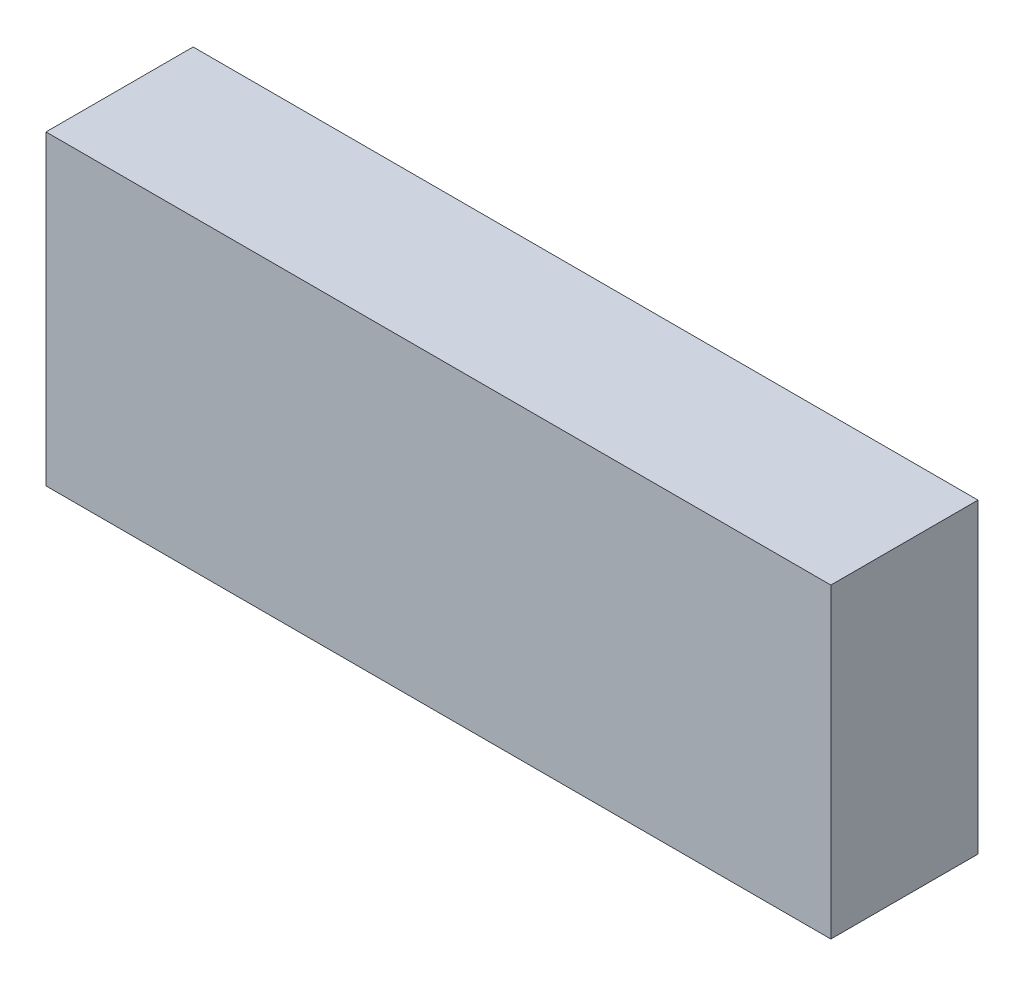
ISO-10303-21;
HEADER;
FILE_DESCRIPTION(('STEP AP214'),'2;1');
FILE_NAME('part.step','',(''),(''),'','','');
FILE_SCHEMA(('AUTOMOTIVE_DESIGN { 1 0 10303 214 1 1 1 1 }'));
ENDSEC;
DATA;
#1=APPLICATION_CONTEXT('core data for automotive mechanical design processes');
#2=APPLICATION_PROTOCOL_DEFINITION('international standard','automotive_design',2000,#1);
#3=PRODUCT_CONTEXT('',#1,'mechanical');
#4=PRODUCT('Part','Part','',(#3));
#5=PRODUCT_RELATED_PRODUCT_CATEGORY('part','',(#4));
#6=PRODUCT_DEFINITION_FORMATION('','',#4);
#7=PRODUCT_DEFINITION_CONTEXT('part definition',#1,'design');
#8=PRODUCT_DEFINITION('design','',#6,#7);
#9=PRODUCT_DEFINITION_SHAPE('','',#8);
#10=(LENGTH_UNIT() NAMED_UNIT(*) SI_UNIT(.MILLI.,.METRE.));
#11=(NAMED_UNIT(*) PLANE_ANGLE_UNIT() SI_UNIT($,.RADIAN.));
#12=(NAMED_UNIT(*) SI_UNIT($,.STERADIAN.) SOLID_ANGLE_UNIT());
#13=UNCERTAINTY_MEASURE_WITH_UNIT(LENGTH_MEASURE(1.E-05),#10,'distance_accuracy_value','');
#14=(GEOMETRIC_REPRESENTATION_CONTEXT(3) GLOBAL_UNCERTAINTY_ASSIGNED_CONTEXT((#13)) GLOBAL_UNIT_ASSIGNED_CONTEXT((#10,
#11,#12)) REPRESENTATION_CONTEXT('',''));
#15=CARTESIAN_POINT('',(0.,0.,0.));
#16=DIRECTION('',(0.,0.,1.));
#17=DIRECTION('',(1.,0.,0.));
#18=AXIS2_PLACEMENT_3D('',#15,#16,#17);
#19=CARTESIAN_POINT('',(1.6,0.625,0.6));
#20=DIRECTION('',(-1.,0.,0.));
#21=DIRECTION('',(0.,0.,1.));
#22=AXIS2_PLACEMENT_3D('',#19,#20,#21);
#23=PLANE('',#22);
#24=DIRECTION('',(0.,0.,-1.));
#25=VECTOR('',#24,1.);
#26=CARTESIAN_POINT('',(1.6,0.625,0.6));
#27=LINE('',#26,#25);
#28=CARTESIAN_POINT('',(1.6,0.625,0.));
#29=VERTEX_POINT('',#28);
#30=CARTESIAN_POINT('',(1.6,0.625,0.6));
#31=VERTEX_POINT('',#30);
#32=EDGE_CURVE('E78',#29,#31,#27,.F.);
#33=ORIENTED_EDGE('',*,*,#32,.T.);
#34=DIRECTION('',(0.,1.,0.));
#35=VECTOR('',#34,1.);
#36=CARTESIAN_POINT('',(1.6,0.,0.6));
#37=LINE('',#36,#35);
#38=CARTESIAN_POINT('',(1.6,-0.625,0.6));
#39=VERTEX_POINT('',#38);
#40=EDGE_CURVE('E66',#31,#39,#37,.F.);
#41=ORIENTED_EDGE('',*,*,#40,.T.);
#42=DIRECTION('',(0.,0.,1.));
#43=VECTOR('',#42,1.);
#44=CARTESIAN_POINT('',(1.6,-0.625,0.6));
#45=LINE('',#44,#43);
#46=CARTESIAN_POINT('',(1.6,-0.625,0.));
#47=VERTEX_POINT('',#46);
#48=EDGE_CURVE('E61',#39,#47,#45,.F.);
#49=ORIENTED_EDGE('',*,*,#48,.T.);
#50=DIRECTION('',(0.,1.,0.));
#51=VECTOR('',#50,1.);
#52=CARTESIAN_POINT('',(1.6,0.625,0.));
#53=LINE('',#52,#51);
#54=EDGE_CURVE('E20',#29,#47,#53,.F.);
#55=ORIENTED_EDGE('',*,*,#54,.F.);
#56=EDGE_LOOP('',(#33,#41,#49,#55));
#57=FACE_BOUND('',#56,.T.);
#58=ADVANCED_FACE('F17',(#57),#23,.F.);
#59=CARTESIAN_POINT('',(-1.6,-0.625,0.6));
#60=DIRECTION('',(1.,0.,0.));
#61=DIRECTION('',(0.,0.,-1.));
#62=AXIS2_PLACEMENT_3D('',#59,#60,#61);
#63=PLANE('',#62);
#64=DIRECTION('',(0.,0.,-1.));
#65=VECTOR('',#64,1.);
#66=CARTESIAN_POINT('',(-1.6,-0.625,0.6));
#67=LINE('',#66,#65);
#68=CARTESIAN_POINT('',(-1.6,-0.625,0.6));
#69=VERTEX_POINT('',#68);
#70=CARTESIAN_POINT('',(-1.6,-0.625,0.));
#71=VERTEX_POINT('',#70);
#72=EDGE_CURVE('E64',#69,#71,#67,.T.);
#73=ORIENTED_EDGE('',*,*,#72,.F.);
#74=DIRECTION('',(0.,1.,0.));
#75=VECTOR('',#74,1.);
#76=CARTESIAN_POINT('',(-1.6,0.,0.6));
#77=LINE('',#76,#75);
#78=CARTESIAN_POINT('',(-1.6,0.625,0.6));
#79=VERTEX_POINT('',#78);
#80=EDGE_CURVE('E65',#69,#79,#77,.T.);
#81=ORIENTED_EDGE('',*,*,#80,.T.);
#82=DIRECTION('',(0.,0.,-1.));
#83=VECTOR('',#82,1.);
#84=CARTESIAN_POINT('',(-1.6,0.625,0.6));
#85=LINE('',#84,#83);
#86=CARTESIAN_POINT('',(-1.6,0.625,0.));
#87=VERTEX_POINT('',#86);
#88=EDGE_CURVE('E80',#79,#87,#85,.T.);
#89=ORIENTED_EDGE('',*,*,#88,.T.);
#90=DIRECTION('',(0.,1.,0.));
#91=VECTOR('',#90,1.);
#92=CARTESIAN_POINT('',(-1.6,-0.625,0.));
#93=LINE('',#92,#91);
#94=EDGE_CURVE('E74',#71,#87,#93,.T.);
#95=ORIENTED_EDGE('',*,*,#94,.F.);
#96=EDGE_LOOP('',(#73,#81,#89,#95));
#97=FACE_BOUND('',#96,.T.);
#98=ADVANCED_FACE('F88',(#97),#63,.F.);
#99=CARTESIAN_POINT('',(0.,0.,0.));
#100=DIRECTION('',(0.,0.,-1.));
#101=DIRECTION('',(-1.,0.,0.));
#102=AXIS2_PLACEMENT_3D('',#99,#100,#101);
#103=PLANE('',#102);
#104=DIRECTION('',(1.,0.,0.));
#105=VECTOR('',#104,1.);
#106=CARTESIAN_POINT('',(-1.6,0.625,0.));
#107=LINE('',#106,#105);
#108=EDGE_CURVE('E70',#87,#29,#107,.T.);
#109=ORIENTED_EDGE('',*,*,#108,.T.);
#110=ORIENTED_EDGE('',*,*,#54,.T.);
#111=DIRECTION('',(1.,0.,0.));
#112=VECTOR('',#111,1.);
#113=CARTESIAN_POINT('',(1.6,-0.625,0.));
#114=LINE('',#113,#112);
#115=EDGE_CURVE('E54',#47,#71,#114,.F.);
#116=ORIENTED_EDGE('',*,*,#115,.T.);
#117=ORIENTED_EDGE('',*,*,#94,.T.);
#118=EDGE_LOOP('',(#109,#110,#116,#117));
#119=FACE_BOUND('',#118,.T.);
#120=ADVANCED_FACE('F69',(#119),#103,.T.);
#121=CARTESIAN_POINT('',(1.6,-0.625,0.6));
#122=DIRECTION('',(0.,1.,0.));
#123=DIRECTION('',(0.,0.,1.));
#124=AXIS2_PLACEMENT_3D('',#121,#122,#123);
#125=PLANE('',#124);
#126=DIRECTION('',(-1.,0.,0.));
#127=VECTOR('',#126,1.);
#128=CARTESIAN_POINT('',(0.,-0.625,0.6));
#129=LINE('',#128,#127);
#130=EDGE_CURVE('E26',#39,#69,#129,.T.);
#131=ORIENTED_EDGE('',*,*,#130,.T.);
#132=ORIENTED_EDGE('',*,*,#72,.T.);
#133=ORIENTED_EDGE('',*,*,#115,.F.);
#134=ORIENTED_EDGE('',*,*,#48,.F.);
#135=EDGE_LOOP('',(#131,#132,#133,#134));
#136=FACE_BOUND('',#135,.T.);
#137=ADVANCED_FACE('F59',(#136),#125,.F.);
#138=CARTESIAN_POINT('',(-1.6,0.625,0.6));
#139=DIRECTION('',(0.,-1.,0.));
#140=DIRECTION('',(0.,0.,-1.));
#141=AXIS2_PLACEMENT_3D('',#138,#139,#140);
#142=PLANE('',#141);
#143=ORIENTED_EDGE('',*,*,#108,.F.);
#144=ORIENTED_EDGE('',*,*,#88,.F.);
#145=DIRECTION('',(-1.,0.,0.));
#146=VECTOR('',#145,1.);
#147=CARTESIAN_POINT('',(0.,0.625,0.6));
#148=LINE('',#147,#146);
#149=EDGE_CURVE('E11',#79,#31,#148,.F.);
#150=ORIENTED_EDGE('',*,*,#149,.T.);
#151=ORIENTED_EDGE('',*,*,#32,.F.);
#152=EDGE_LOOP('',(#143,#144,#150,#151));
#153=FACE_BOUND('',#152,.T.);
#154=ADVANCED_FACE('F91',(#153),#142,.F.);
#155=CARTESIAN_POINT('',(0.,0.,0.6));
#156=DIRECTION('',(0.,0.,-1.));
#157=DIRECTION('',(-1.,0.,0.));
#158=AXIS2_PLACEMENT_3D('',#155,#156,#157);
#159=PLANE('',#158);
#160=ORIENTED_EDGE('',*,*,#149,.F.);
#161=ORIENTED_EDGE('',*,*,#80,.F.);
#162=ORIENTED_EDGE('',*,*,#130,.F.);
#163=ORIENTED_EDGE('',*,*,#40,.F.);
#164=EDGE_LOOP('',(#160,#161,#162,#163));
#165=FACE_BOUND('',#164,.T.);
#166=ADVANCED_FACE('F89',(#165),#159,.F.);
#167=CLOSED_SHELL('',(#58,#98,#120,#137,#154,#166));
#168=MANIFOLD_SOLID_BREP('B1',#167);
#169=ADVANCED_BREP_SHAPE_REPRESENTATION('',(#18,#168),#14);
#170=SHAPE_DEFINITION_REPRESENTATION(#9,#169);
ENDSEC;
END-ISO-10303-21;
